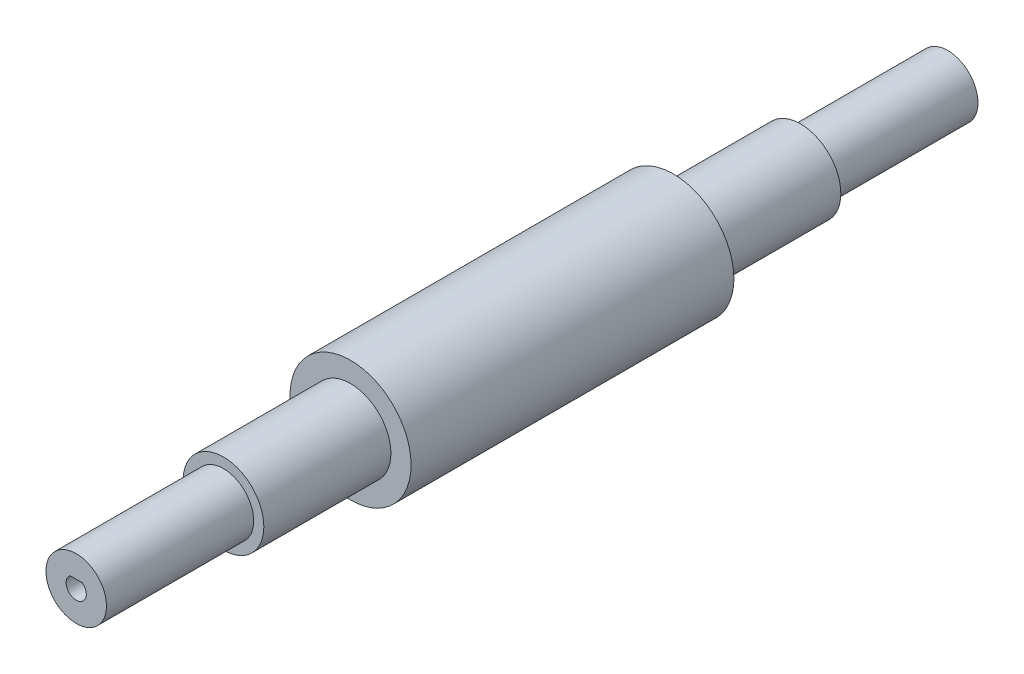
ISO-10303-21;
HEADER;
FILE_DESCRIPTION(('STEP AP214'),'2;1');
FILE_NAME('part.step','',(''),(''),'','','');
FILE_SCHEMA(('AUTOMOTIVE_DESIGN { 1 0 10303 214 1 1 1 1 }'));
ENDSEC;
DATA;
#1=APPLICATION_CONTEXT('core data for automotive mechanical design processes');
#2=APPLICATION_PROTOCOL_DEFINITION('international standard','automotive_design',2000,#1);
#3=PRODUCT_CONTEXT('',#1,'mechanical');
#4=PRODUCT('Part','Part','',(#3));
#5=PRODUCT_RELATED_PRODUCT_CATEGORY('part','',(#4));
#6=PRODUCT_DEFINITION_FORMATION('','',#4);
#7=PRODUCT_DEFINITION_CONTEXT('part definition',#1,'design');
#8=PRODUCT_DEFINITION('design','',#6,#7);
#9=PRODUCT_DEFINITION_SHAPE('','',#8);
#10=(LENGTH_UNIT() NAMED_UNIT(*) SI_UNIT(.MILLI.,.METRE.));
#11=(NAMED_UNIT(*) PLANE_ANGLE_UNIT() SI_UNIT($,.RADIAN.));
#12=(NAMED_UNIT(*) SI_UNIT($,.STERADIAN.) SOLID_ANGLE_UNIT());
#13=UNCERTAINTY_MEASURE_WITH_UNIT(LENGTH_MEASURE(1.E-05),#10,'distance_accuracy_value','');
#14=(GEOMETRIC_REPRESENTATION_CONTEXT(3) GLOBAL_UNCERTAINTY_ASSIGNED_CONTEXT((#13)) GLOBAL_UNIT_ASSIGNED_CONTEXT((#10,
#11,#12)) REPRESENTATION_CONTEXT('',''));
#15=CARTESIAN_POINT('',(0.,0.,0.));
#16=DIRECTION('',(0.,0.,1.));
#17=DIRECTION('',(1.,0.,0.));
#18=AXIS2_PLACEMENT_3D('',#15,#16,#17);
#19=CARTESIAN_POINT('',(0.,0.,-108.));
#20=DIRECTION('',(0.,0.,1.));
#21=DIRECTION('',(1.,0.,0.));
#22=AXIS2_PLACEMENT_3D('',#19,#20,#21);
#23=CYLINDRICAL_SURFACE('',#22,7.5);
#24=CARTESIAN_POINT('',(0.,0.,-108.));
#25=DIRECTION('',(0.,0.,1.));
#26=DIRECTION('',(1.,0.,0.));
#27=AXIS2_PLACEMENT_3D('',#24,#25,#26);
#28=CIRCLE('',#27,7.5);
#29=CARTESIAN_POINT('',(7.5,0.,-108.));
#30=VERTEX_POINT('',#29);
#31=EDGE_CURVE('E13',#30,#30,#28,.T.);
#32=ORIENTED_EDGE('',*,*,#31,.T.);
#33=EDGE_LOOP('',(#32));
#34=FACE_BOUND('',#33,.T.);
#35=CARTESIAN_POINT('',(0.,0.,-71.5));
#36=DIRECTION('',(0.,0.,1.));
#37=DIRECTION('',(1.,0.,0.));
#38=AXIS2_PLACEMENT_3D('',#35,#36,#37);
#39=CIRCLE('',#38,7.5);
#40=CARTESIAN_POINT('',(7.5,0.,-71.5));
#41=VERTEX_POINT('',#40);
#42=EDGE_CURVE('E72',#41,#41,#39,.T.);
#43=ORIENTED_EDGE('',*,*,#42,.F.);
#44=EDGE_LOOP('',(#43));
#45=FACE_BOUND('',#44,.T.);
#46=ADVANCED_FACE('F69',(#34,#45),#23,.T.);
#47=CARTESIAN_POINT('',(0.,0.,-108.));
#48=DIRECTION('',(0.,0.,1.));
#49=DIRECTION('',(1.,0.,0.));
#50=AXIS2_PLACEMENT_3D('',#47,#48,#49);
#51=PLANE('',#50);
#52=DIRECTION('',(1.,0.,0.));
#53=VECTOR('',#52,1.);
#54=CARTESIAN_POINT('',(-1.5,2.,-108.));
#55=LINE('',#54,#53);
#56=CARTESIAN_POINT('',(-1.5,2.,-108.));
#57=VERTEX_POINT('',#56);
#58=CARTESIAN_POINT('',(1.5,2.,-108.));
#59=VERTEX_POINT('',#58);
#60=EDGE_CURVE('E91',#57,#59,#55,.T.);
#61=ORIENTED_EDGE('',*,*,#60,.F.);
#62=CARTESIAN_POINT('',(0.,0.,-108.));
#63=DIRECTION('',(0.,0.,1.));
#64=DIRECTION('',(1.,0.,0.));
#65=AXIS2_PLACEMENT_3D('',#62,#63,#64);
#66=CIRCLE('',#65,2.5);
#67=EDGE_CURVE('E83',#57,#59,#66,.T.);
#68=ORIENTED_EDGE('',*,*,#67,.T.);
#69=EDGE_LOOP('',(#61,#68));
#70=FACE_BOUND('',#69,.T.);
#71=ORIENTED_EDGE('',*,*,#31,.F.);
#72=EDGE_LOOP('',(#71));
#73=FACE_BOUND('',#72,.T.);
#74=ADVANCED_FACE('F120',(#70,#73),#51,.F.);
#75=CARTESIAN_POINT('',(0.,0.,-108.));
#76=DIRECTION('',(0.,0.,1.));
#77=DIRECTION('',(1.,0.,0.));
#78=AXIS2_PLACEMENT_3D('',#75,#76,#77);
#79=CYLINDRICAL_SURFACE('',#78,2.5);
#80=CARTESIAN_POINT('',(0.,0.,-71.5));
#81=DIRECTION('',(0.,0.,1.));
#82=DIRECTION('',(1.,0.,0.));
#83=AXIS2_PLACEMENT_3D('',#80,#81,#82);
#84=CIRCLE('',#83,2.5);
#85=CARTESIAN_POINT('',(-1.5,2.,-71.5));
#86=VERTEX_POINT('',#85);
#87=CARTESIAN_POINT('',(1.5,2.,-71.5));
#88=VERTEX_POINT('',#87);
#89=EDGE_CURVE('E103',#86,#88,#84,.T.);
#90=ORIENTED_EDGE('',*,*,#89,.T.);
#91=DIRECTION('',(0.,0.,1.));
#92=VECTOR('',#91,1.);
#93=CARTESIAN_POINT('',(1.5,2.,-108.));
#94=LINE('',#93,#92);
#95=EDGE_CURVE('E95',#59,#88,#94,.T.);
#96=ORIENTED_EDGE('',*,*,#95,.F.);
#97=ORIENTED_EDGE('',*,*,#67,.F.);
#98=DIRECTION('',(0.,0.,1.));
#99=VECTOR('',#98,1.);
#100=CARTESIAN_POINT('',(-1.5,2.,-108.));
#101=LINE('',#100,#99);
#102=EDGE_CURVE('E101',#57,#86,#101,.T.);
#103=ORIENTED_EDGE('',*,*,#102,.T.);
#104=EDGE_LOOP('',(#90,#96,#97,#103));
#105=FACE_BOUND('',#104,.T.);
#106=ADVANCED_FACE('F104',(#105),#79,.F.);
#107=CARTESIAN_POINT('',(-1.5,2.,-108.));
#108=DIRECTION('',(0.,-1.,0.));
#109=DIRECTION('',(0.,0.,-1.));
#110=AXIS2_PLACEMENT_3D('',#107,#108,#109);
#111=PLANE('',#110);
#112=DIRECTION('',(1.,0.,0.));
#113=VECTOR('',#112,1.);
#114=CARTESIAN_POINT('',(-1.5,2.,-71.5));
#115=LINE('',#114,#113);
#116=EDGE_CURVE('E99',#86,#88,#115,.T.);
#117=ORIENTED_EDGE('',*,*,#116,.F.);
#118=ORIENTED_EDGE('',*,*,#102,.F.);
#119=ORIENTED_EDGE('',*,*,#60,.T.);
#120=ORIENTED_EDGE('',*,*,#95,.T.);
#121=EDGE_LOOP('',(#117,#118,#119,#120));
#122=FACE_BOUND('',#121,.T.);
#123=ADVANCED_FACE('F97',(#122),#111,.T.);
#124=CARTESIAN_POINT('',(0.,0.,-71.5));
#125=DIRECTION('',(0.,0.,1.));
#126=DIRECTION('',(1.,0.,0.));
#127=AXIS2_PLACEMENT_3D('',#124,#125,#126);
#128=PLANE('',#127);
#129=ORIENTED_EDGE('',*,*,#42,.T.);
#130=EDGE_LOOP('',(#129));
#131=FACE_BOUND('',#130,.T.);
#132=CARTESIAN_POINT('',(0.,0.,-71.5));
#133=DIRECTION('',(0.,0.,1.));
#134=DIRECTION('',(1.,0.,0.));
#135=AXIS2_PLACEMENT_3D('',#132,#133,#134);
#136=CIRCLE('',#135,10.);
#137=CARTESIAN_POINT('',(10.,0.,-71.5));
#138=VERTEX_POINT('',#137);
#139=EDGE_CURVE('E106',#138,#138,#136,.T.);
#140=ORIENTED_EDGE('',*,*,#139,.F.);
#141=EDGE_LOOP('',(#140));
#142=FACE_BOUND('',#141,.T.);
#143=ADVANCED_FACE('F116',(#131,#142),#128,.F.);
#144=CARTESIAN_POINT('',(0.,0.,-71.5));
#145=DIRECTION('',(0.,0.,1.));
#146=DIRECTION('',(1.,0.,0.));
#147=AXIS2_PLACEMENT_3D('',#144,#145,#146);
#148=CYLINDRICAL_SURFACE('',#147,10.);
#149=ORIENTED_EDGE('',*,*,#139,.T.);
#150=EDGE_LOOP('',(#149));
#151=FACE_BOUND('',#150,.T.);
#152=CARTESIAN_POINT('',(0.,0.,-40.));
#153=DIRECTION('',(0.,0.,1.));
#154=DIRECTION('',(1.,0.,0.));
#155=AXIS2_PLACEMENT_3D('',#152,#153,#154);
#156=CIRCLE('',#155,10.);
#157=CARTESIAN_POINT('',(10.,0.,-40.));
#158=VERTEX_POINT('',#157);
#159=EDGE_CURVE('E174',#158,#158,#156,.T.);
#160=ORIENTED_EDGE('',*,*,#159,.F.);
#161=EDGE_LOOP('',(#160));
#162=FACE_BOUND('',#161,.T.);
#163=ADVANCED_FACE('F135',(#151,#162),#148,.T.);
#164=ORIENTED_EDGE('',*,*,#89,.F.);
#165=ORIENTED_EDGE('',*,*,#116,.T.);
#166=EDGE_LOOP('',(#164,#165));
#167=FACE_BOUND('',#166,.T.);
#168=ADVANCED_FACE('F108',(#167),#128,.F.);
#169=CARTESIAN_POINT('',(0.,0.,40.));
#170=DIRECTION('',(0.,0.,-1.));
#171=DIRECTION('',(-1.,0.,0.));
#172=AXIS2_PLACEMENT_3D('',#169,#170,#171);
#173=CYLINDRICAL_SURFACE('',#172,15.);
#174=CARTESIAN_POINT('',(0.,0.,40.));
#175=DIRECTION('',(0.,0.,1.));
#176=DIRECTION('',(1.,0.,0.));
#177=AXIS2_PLACEMENT_3D('',#174,#175,#176);
#178=CIRCLE('',#177,15.);
#179=CARTESIAN_POINT('',(15.,0.,40.));
#180=VERTEX_POINT('',#179);
#181=EDGE_CURVE('E168',#180,#180,#178,.T.);
#182=ORIENTED_EDGE('',*,*,#181,.F.);
#183=EDGE_LOOP('',(#182));
#184=FACE_BOUND('',#183,.T.);
#185=CARTESIAN_POINT('',(0.,0.,-40.));
#186=DIRECTION('',(0.,0.,1.));
#187=DIRECTION('',(1.,0.,0.));
#188=AXIS2_PLACEMENT_3D('',#185,#186,#187);
#189=CIRCLE('',#188,15.);
#190=CARTESIAN_POINT('',(15.,0.,-40.));
#191=VERTEX_POINT('',#190);
#192=EDGE_CURVE('E165',#191,#191,#189,.T.);
#193=ORIENTED_EDGE('',*,*,#192,.T.);
#194=EDGE_LOOP('',(#193));
#195=FACE_BOUND('',#194,.T.);
#196=ADVANCED_FACE('F141',(#184,#195),#173,.T.);
#197=CARTESIAN_POINT('',(0.,0.,40.));
#198=DIRECTION('',(0.,0.,1.));
#199=DIRECTION('',(1.,0.,0.));
#200=AXIS2_PLACEMENT_3D('',#197,#198,#199);
#201=PLANE('',#200);
#202=CARTESIAN_POINT('',(0.,0.,40.));
#203=DIRECTION('',(0.,0.,1.));
#204=DIRECTION('',(1.,0.,0.));
#205=AXIS2_PLACEMENT_3D('',#202,#203,#204);
#206=CIRCLE('',#205,10.);
#207=CARTESIAN_POINT('',(10.,0.,40.));
#208=VERTEX_POINT('',#207);
#209=EDGE_CURVE('E171',#208,#208,#206,.T.);
#210=ORIENTED_EDGE('',*,*,#209,.F.);
#211=EDGE_LOOP('',(#210));
#212=FACE_BOUND('',#211,.T.);
#213=ORIENTED_EDGE('',*,*,#181,.T.);
#214=EDGE_LOOP('',(#213));
#215=FACE_BOUND('',#214,.T.);
#216=ADVANCED_FACE('F144',(#212,#215),#201,.T.);
#217=CARTESIAN_POINT('',(0.,0.,-40.));
#218=DIRECTION('',(0.,0.,1.));
#219=DIRECTION('',(1.,0.,0.));
#220=AXIS2_PLACEMENT_3D('',#217,#218,#219);
#221=PLANE('',#220);
#222=ORIENTED_EDGE('',*,*,#159,.T.);
#223=EDGE_LOOP('',(#222));
#224=FACE_BOUND('',#223,.T.);
#225=ORIENTED_EDGE('',*,*,#192,.F.);
#226=EDGE_LOOP('',(#225));
#227=FACE_BOUND('',#226,.T.);
#228=ADVANCED_FACE('F146',(#224,#227),#221,.F.);
#229=CARTESIAN_POINT('',(0.,0.,71.5));
#230=DIRECTION('',(0.,0.,-1.));
#231=DIRECTION('',(-1.,0.,0.));
#232=AXIS2_PLACEMENT_3D('',#229,#230,#231);
#233=CYLINDRICAL_SURFACE('',#232,10.);
#234=CARTESIAN_POINT('',(0.,0.,71.5));
#235=DIRECTION('',(0.,0.,1.));
#236=DIRECTION('',(1.,0.,0.));
#237=AXIS2_PLACEMENT_3D('',#234,#235,#236);
#238=CIRCLE('',#237,10.);
#239=CARTESIAN_POINT('',(10.,0.,71.5));
#240=VERTEX_POINT('',#239);
#241=EDGE_CURVE('E164',#240,#240,#238,.T.);
#242=ORIENTED_EDGE('',*,*,#241,.F.);
#243=EDGE_LOOP('',(#242));
#244=FACE_BOUND('',#243,.T.);
#245=ORIENTED_EDGE('',*,*,#209,.T.);
#246=EDGE_LOOP('',(#245));
#247=FACE_BOUND('',#246,.T.);
#248=ADVANCED_FACE('F149',(#244,#247),#233,.T.);
#249=CARTESIAN_POINT('',(0.,0.,71.5));
#250=DIRECTION('',(0.,0.,1.));
#251=DIRECTION('',(1.,0.,0.));
#252=AXIS2_PLACEMENT_3D('',#249,#250,#251);
#253=PLANE('',#252);
#254=ORIENTED_EDGE('',*,*,#241,.T.);
#255=EDGE_LOOP('',(#254));
#256=FACE_BOUND('',#255,.T.);
#257=ADVANCED_FACE('F156',(#256),#253,.T.);
#258=CLOSED_SHELL('',(#46,#74,#106,#123,#143,#163,#168,#196,#216,#228,#248,#257));
#259=MANIFOLD_SOLID_BREP('B2',#258);
#260=CARTESIAN_POINT('',(0.,0.,108.));
#261=DIRECTION('',(0.,0.,1.));
#262=DIRECTION('',(1.,0.,0.));
#263=AXIS2_PLACEMENT_3D('',#260,#261,#262);
#264=PLANE('',#263);
#265=CARTESIAN_POINT('',(0.,0.,108.));
#266=DIRECTION('',(0.,0.,1.));
#267=DIRECTION('',(1.,0.,0.));
#268=AXIS2_PLACEMENT_3D('',#265,#266,#267);
#269=CIRCLE('',#268,7.5);
#270=CARTESIAN_POINT('',(7.5,0.,108.));
#271=VERTEX_POINT('',#270);
#272=EDGE_CURVE('E67',#271,#271,#269,.T.);
#273=ORIENTED_EDGE('',*,*,#272,.T.);
#274=EDGE_LOOP('',(#273));
#275=FACE_BOUND('',#274,.T.);
#276=DIRECTION('',(1.,0.,0.));
#277=VECTOR('',#276,1.);
#278=CARTESIAN_POINT('',(-1.5,2.,108.));
#279=LINE('',#278,#277);
#280=CARTESIAN_POINT('',(-1.5,2.,108.));
#281=VERTEX_POINT('',#280);
#282=CARTESIAN_POINT('',(1.5,2.,108.));
#283=VERTEX_POINT('',#282);
#284=EDGE_CURVE('E325',#281,#283,#279,.T.);
#285=ORIENTED_EDGE('',*,*,#284,.T.);
#286=CARTESIAN_POINT('',(0.,0.,108.));
#287=DIRECTION('',(0.,0.,1.));
#288=DIRECTION('',(1.,0.,0.));
#289=AXIS2_PLACEMENT_3D('',#286,#287,#288);
#290=CIRCLE('',#289,2.5);
#291=EDGE_CURVE('E313',#281,#283,#290,.T.);
#292=ORIENTED_EDGE('',*,*,#291,.F.);
#293=EDGE_LOOP('',(#285,#292));
#294=FACE_BOUND('',#293,.T.);
#295=ADVANCED_FACE('F284',(#275,#294),#264,.T.);
#296=CARTESIAN_POINT('',(0.,0.,71.5));
#297=DIRECTION('',(0.,0.,1.));
#298=DIRECTION('',(1.,0.,0.));
#299=AXIS2_PLACEMENT_3D('',#296,#297,#298);
#300=PLANE('',#299);
#301=CARTESIAN_POINT('',(0.,0.,71.5));
#302=DIRECTION('',(0.,0.,1.));
#303=DIRECTION('',(1.,0.,0.));
#304=AXIS2_PLACEMENT_3D('',#301,#302,#303);
#305=CIRCLE('',#304,7.5);
#306=CARTESIAN_POINT('',(7.5,0.,71.5));
#307=VERTEX_POINT('',#306);
#308=EDGE_CURVE('E288',#307,#307,#305,.T.);
#309=ORIENTED_EDGE('',*,*,#308,.F.);
#310=EDGE_LOOP('',(#309));
#311=FACE_BOUND('',#310,.T.);
#312=CARTESIAN_POINT('',(0.,0.,71.5));
#313=DIRECTION('',(0.,0.,1.));
#314=DIRECTION('',(1.,0.,0.));
#315=AXIS2_PLACEMENT_3D('',#312,#313,#314);
#316=CIRCLE('',#315,2.5);
#317=CARTESIAN_POINT('',(-1.5,2.,71.5));
#318=VERTEX_POINT('',#317);
#319=CARTESIAN_POINT('',(1.5,2.,71.5));
#320=VERTEX_POINT('',#319);
#321=EDGE_CURVE('E306',#318,#320,#316,.T.);
#322=ORIENTED_EDGE('',*,*,#321,.T.);
#323=DIRECTION('',(1.,0.,0.));
#324=VECTOR('',#323,1.);
#325=CARTESIAN_POINT('',(-1.5,2.,71.5));
#326=LINE('',#325,#324);
#327=EDGE_CURVE('E318',#318,#320,#326,.T.);
#328=ORIENTED_EDGE('',*,*,#327,.F.);
#329=EDGE_LOOP('',(#322,#328));
#330=FACE_BOUND('',#329,.T.);
#331=ADVANCED_FACE('F322',(#311,#330),#300,.F.);
#332=CARTESIAN_POINT('',(0.,0.,108.));
#333=DIRECTION('',(0.,0.,-1.));
#334=DIRECTION('',(-1.,0.,0.));
#335=AXIS2_PLACEMENT_3D('',#332,#333,#334);
#336=CYLINDRICAL_SURFACE('',#335,7.5);
#337=ORIENTED_EDGE('',*,*,#272,.F.);
#338=EDGE_LOOP('',(#337));
#339=FACE_BOUND('',#338,.T.);
#340=ORIENTED_EDGE('',*,*,#308,.T.);
#341=EDGE_LOOP('',(#340));
#342=FACE_BOUND('',#341,.T.);
#343=ADVANCED_FACE('F286',(#339,#342),#336,.T.);
#344=CARTESIAN_POINT('',(0.,0.,108.));
#345=DIRECTION('',(0.,0.,-1.));
#346=DIRECTION('',(-1.,0.,0.));
#347=AXIS2_PLACEMENT_3D('',#344,#345,#346);
#348=CYLINDRICAL_SURFACE('',#347,2.5);
#349=ORIENTED_EDGE('',*,*,#321,.F.);
#350=DIRECTION('',(0.,0.,-1.));
#351=VECTOR('',#350,1.);
#352=CARTESIAN_POINT('',(-1.5,2.,108.));
#353=LINE('',#352,#351);
#354=EDGE_CURVE('E315',#281,#318,#353,.T.);
#355=ORIENTED_EDGE('',*,*,#354,.F.);
#356=ORIENTED_EDGE('',*,*,#291,.T.);
#357=DIRECTION('',(0.,0.,-1.));
#358=VECTOR('',#357,1.);
#359=CARTESIAN_POINT('',(1.5,2.,108.));
#360=LINE('',#359,#358);
#361=EDGE_CURVE('E299',#283,#320,#360,.T.);
#362=ORIENTED_EDGE('',*,*,#361,.T.);
#363=EDGE_LOOP('',(#349,#355,#356,#362));
#364=FACE_BOUND('',#363,.T.);
#365=ADVANCED_FACE('F311',(#364),#348,.F.);
#366=CARTESIAN_POINT('',(-1.5,2.,108.));
#367=DIRECTION('',(0.,1.,0.));
#368=DIRECTION('',(0.,0.,1.));
#369=AXIS2_PLACEMENT_3D('',#366,#367,#368);
#370=PLANE('',#369);
#371=ORIENTED_EDGE('',*,*,#327,.T.);
#372=ORIENTED_EDGE('',*,*,#361,.F.);
#373=ORIENTED_EDGE('',*,*,#284,.F.);
#374=ORIENTED_EDGE('',*,*,#354,.T.);
#375=EDGE_LOOP('',(#371,#372,#373,#374));
#376=FACE_BOUND('',#375,.T.);
#377=ADVANCED_FACE('F319',(#376),#370,.F.);
#378=CLOSED_SHELL('',(#295,#331,#343,#365,#377));
#379=MANIFOLD_SOLID_BREP('B7',#378);
#380=ADVANCED_BREP_SHAPE_REPRESENTATION('',(#18,#259,#379),#14);
#381=SHAPE_DEFINITION_REPRESENTATION(#9,#380);
ENDSEC;
END-ISO-10303-21;
